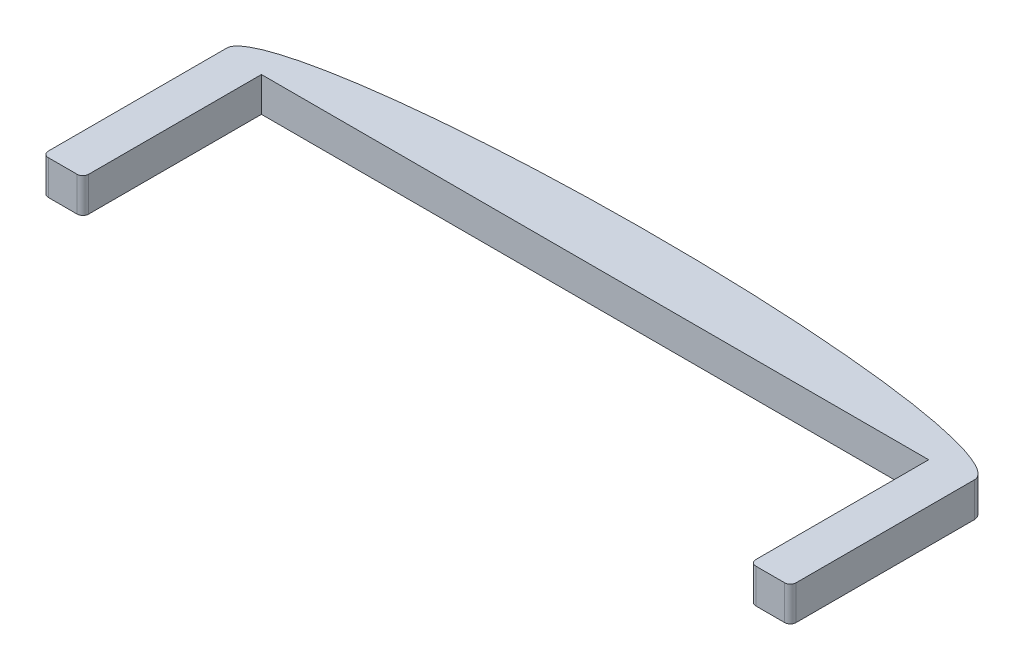
ISO-10303-21;
HEADER;
FILE_DESCRIPTION(('STEP AP214'),'2;1');
FILE_NAME('part.step','',(''),(''),'','','');
FILE_SCHEMA(('AUTOMOTIVE_DESIGN { 1 0 10303 214 1 1 1 1 }'));
ENDSEC;
DATA;
#1=APPLICATION_CONTEXT('core data for automotive mechanical design processes');
#2=APPLICATION_PROTOCOL_DEFINITION('international standard','automotive_design',2000,#1);
#3=PRODUCT_CONTEXT('',#1,'mechanical');
#4=PRODUCT('Part','Part','',(#3));
#5=PRODUCT_RELATED_PRODUCT_CATEGORY('part','',(#4));
#6=PRODUCT_DEFINITION_FORMATION('','',#4);
#7=PRODUCT_DEFINITION_CONTEXT('part definition',#1,'design');
#8=PRODUCT_DEFINITION('design','',#6,#7);
#9=PRODUCT_DEFINITION_SHAPE('','',#8);
#10=(LENGTH_UNIT() NAMED_UNIT(*) SI_UNIT(.MILLI.,.METRE.));
#11=(NAMED_UNIT(*) PLANE_ANGLE_UNIT() SI_UNIT($,.RADIAN.));
#12=(NAMED_UNIT(*) SI_UNIT($,.STERADIAN.) SOLID_ANGLE_UNIT());
#13=UNCERTAINTY_MEASURE_WITH_UNIT(LENGTH_MEASURE(1.E-05),#10,'distance_accuracy_value','');
#14=(GEOMETRIC_REPRESENTATION_CONTEXT(3) GLOBAL_UNCERTAINTY_ASSIGNED_CONTEXT((#13)) GLOBAL_UNIT_ASSIGNED_CONTEXT((#10,
#11,#12)) REPRESENTATION_CONTEXT('',''));
#15=CARTESIAN_POINT('',(0.,0.,0.));
#16=DIRECTION('',(0.,0.,1.));
#17=DIRECTION('',(1.,0.,0.));
#18=AXIS2_PLACEMENT_3D('',#15,#16,#17);
#19=CARTESIAN_POINT('',(0.,3.,0.));
#20=DIRECTION('',(0.,0.,-1.));
#21=DIRECTION('',(-1.,0.,0.));
#22=AXIS2_PLACEMENT_3D('',#19,#20,#21);
#23=PLANE('',#22);
#24=DIRECTION('',(1.,0.,0.));
#25=VECTOR('',#24,1.);
#26=CARTESIAN_POINT('',(0.,3.,0.));
#27=LINE('',#26,#25);
#28=CARTESIAN_POINT('',(29.5,3.,0.));
#29=VERTEX_POINT('',#28);
#30=CARTESIAN_POINT('',(32.,3.,0.));
#31=VERTEX_POINT('',#30);
#32=EDGE_CURVE('E235',#29,#31,#27,.T.);
#33=ORIENTED_EDGE('',*,*,#32,.F.);
#34=DIRECTION('',(0.,-1.,0.));
#35=VECTOR('',#34,1.);
#36=CARTESIAN_POINT('',(29.5,3.,0.));
#37=LINE('',#36,#35);
#38=CARTESIAN_POINT('',(29.5,0.,0.));
#39=VERTEX_POINT('',#38);
#40=EDGE_CURVE('E42',#29,#39,#37,.T.);
#41=ORIENTED_EDGE('',*,*,#40,.T.);
#42=DIRECTION('',(1.,0.,0.));
#43=VECTOR('',#42,1.);
#44=CARTESIAN_POINT('',(0.,0.,0.));
#45=LINE('',#44,#43);
#46=CARTESIAN_POINT('',(32.,0.,0.));
#47=VERTEX_POINT('',#46);
#48=EDGE_CURVE('E221',#39,#47,#45,.T.);
#49=ORIENTED_EDGE('',*,*,#48,.T.);
#50=DIRECTION('',(0.,-1.,0.));
#51=VECTOR('',#50,1.);
#52=CARTESIAN_POINT('',(32.,3.,0.));
#53=LINE('',#52,#51);
#54=EDGE_CURVE('E254',#47,#31,#53,.F.);
#55=ORIENTED_EDGE('',*,*,#54,.T.);
#56=EDGE_LOOP('',(#33,#41,#49,#55));
#57=FACE_BOUND('',#56,.T.);
#58=ADVANCED_FACE('F34',(#57),#23,.F.);
#59=CARTESIAN_POINT('',(0.,3.,-16.));
#60=DIRECTION('',(0.,1.,0.));
#61=DIRECTION('',(-1.,0.,0.));
#62=AXIS2_PLACEMENT_3D('',#59,#60,#61);
#63=ELLIPSE('',#62,32.5,4.5);
#64=DIRECTION('',(0.,-1.,0.));
#65=VECTOR('',#64,1.);
#66=SURFACE_OF_LINEAR_EXTRUSION('',#63,#65);
#67=CARTESIAN_POINT('',(0.,0.,-16.));
#68=DIRECTION('',(0.,1.,0.));
#69=DIRECTION('',(-1.,0.,0.));
#70=AXIS2_PLACEMENT_3D('',#67,#68,#69);
#71=ELLIPSE('',#70,32.5,4.5);
#72=CARTESIAN_POINT('',(32.5,0.,-16.));
#73=VERTEX_POINT('',#72);
#74=CARTESIAN_POINT('',(-32.5,0.,-16.));
#75=VERTEX_POINT('',#74);
#76=EDGE_CURVE('E164',#73,#75,#71,.T.);
#77=ORIENTED_EDGE('',*,*,#76,.T.);
#78=DIRECTION('',(0.,-1.,0.));
#79=VECTOR('',#78,1.);
#80=CARTESIAN_POINT('',(-32.5,3.,-16.));
#81=LINE('',#80,#79);
#82=CARTESIAN_POINT('',(-32.5,3.,-16.));
#83=VERTEX_POINT('',#82);
#84=EDGE_CURVE('E244',#83,#75,#81,.T.);
#85=ORIENTED_EDGE('',*,*,#84,.F.);
#86=CARTESIAN_POINT('',(32.5,3.,-16.));
#87=VERTEX_POINT('',#86);
#88=EDGE_CURVE('E165',#87,#83,#63,.T.);
#89=ORIENTED_EDGE('',*,*,#88,.F.);
#90=DIRECTION('',(0.,-1.,0.));
#91=VECTOR('',#90,1.);
#92=CARTESIAN_POINT('',(32.5,3.,-16.));
#93=LINE('',#92,#91);
#94=EDGE_CURVE('E159',#87,#73,#93,.T.);
#95=ORIENTED_EDGE('',*,*,#94,.T.);
#96=EDGE_LOOP('',(#77,#85,#89,#95));
#97=FACE_BOUND('',#96,.T.);
#98=ADVANCED_FACE('F172',(#97),#66,.F.);
#99=CARTESIAN_POINT('',(-32.5,3.,0.));
#100=DIRECTION('',(1.,0.,0.));
#101=DIRECTION('',(0.,0.,-1.));
#102=AXIS2_PLACEMENT_3D('',#99,#100,#101);
#103=PLANE('',#102);
#104=DIRECTION('',(0.,0.,1.));
#105=VECTOR('',#104,1.);
#106=CARTESIAN_POINT('',(-32.5,0.,0.));
#107=LINE('',#106,#105);
#108=CARTESIAN_POINT('',(-32.5,0.,-0.499999999999996));
#109=VERTEX_POINT('',#108);
#110=EDGE_CURVE('E239',#75,#109,#107,.T.);
#111=ORIENTED_EDGE('',*,*,#110,.T.);
#112=DIRECTION('',(0.,-1.,0.));
#113=VECTOR('',#112,1.);
#114=CARTESIAN_POINT('',(-32.5,3.,-0.499999999999996));
#115=LINE('',#114,#113);
#116=CARTESIAN_POINT('',(-32.5,3.,-0.499999999999996));
#117=VERTEX_POINT('',#116);
#118=EDGE_CURVE('E261',#109,#117,#115,.F.);
#119=ORIENTED_EDGE('',*,*,#118,.T.);
#120=DIRECTION('',(0.,0.,1.));
#121=VECTOR('',#120,1.);
#122=CARTESIAN_POINT('',(-32.5,3.,0.));
#123=LINE('',#122,#121);
#124=EDGE_CURVE('E168',#83,#117,#123,.T.);
#125=ORIENTED_EDGE('',*,*,#124,.F.);
#126=ORIENTED_EDGE('',*,*,#84,.T.);
#127=EDGE_LOOP('',(#111,#119,#125,#126));
#128=FACE_BOUND('',#127,.T.);
#129=ADVANCED_FACE('F176',(#128),#103,.F.);
#130=CARTESIAN_POINT('',(-32.,0.,0.));
#131=VERTEX_POINT('',#130);
#132=CARTESIAN_POINT('',(-29.5,0.,0.));
#133=VERTEX_POINT('',#132);
#134=EDGE_CURVE('E169',#131,#133,#45,.T.);
#135=ORIENTED_EDGE('',*,*,#134,.T.);
#136=DIRECTION('',(0.,-1.,0.));
#137=VECTOR('',#136,1.);
#138=CARTESIAN_POINT('',(-29.5,3.,0.));
#139=LINE('',#138,#137);
#140=CARTESIAN_POINT('',(-29.5,3.,0.));
#141=VERTEX_POINT('',#140);
#142=EDGE_CURVE('E217',#133,#141,#139,.F.);
#143=ORIENTED_EDGE('',*,*,#142,.T.);
#144=CARTESIAN_POINT('',(-32.,3.,0.));
#145=VERTEX_POINT('',#144);
#146=EDGE_CURVE('E248',#145,#141,#27,.T.);
#147=ORIENTED_EDGE('',*,*,#146,.F.);
#148=DIRECTION('',(0.,-1.,0.));
#149=VECTOR('',#148,1.);
#150=CARTESIAN_POINT('',(-32.,3.,0.));
#151=LINE('',#150,#149);
#152=EDGE_CURVE('E219',#145,#131,#151,.T.);
#153=ORIENTED_EDGE('',*,*,#152,.T.);
#154=EDGE_LOOP('',(#135,#143,#147,#153));
#155=FACE_BOUND('',#154,.T.);
#156=ADVANCED_FACE('F199',(#155),#23,.F.);
#157=CARTESIAN_POINT('',(0.,3.,-16.));
#158=DIRECTION('',(0.,1.,0.));
#159=DIRECTION('',(0.,0.,1.));
#160=AXIS2_PLACEMENT_3D('',#157,#158,#159);
#161=PLANE('',#160);
#162=ORIENTED_EDGE('',*,*,#146,.T.);
#163=CARTESIAN_POINT('',(-29.5,3.,-0.499999999999996));
#164=DIRECTION('',(0.,1.,0.));
#165=DIRECTION('',(0.,0.,1.));
#166=AXIS2_PLACEMENT_3D('',#163,#164,#165);
#167=CIRCLE('',#166,0.5);
#168=CARTESIAN_POINT('',(-29.,3.,-0.499999999999996));
#169=VERTEX_POINT('',#168);
#170=EDGE_CURVE('E129',#141,#169,#167,.T.);
#171=ORIENTED_EDGE('',*,*,#170,.T.);
#172=DIRECTION('',(0.,0.,-1.));
#173=VECTOR('',#172,1.);
#174=CARTESIAN_POINT('',(-29.,3.,-1.82150000000006));
#175=LINE('',#174,#173);
#176=CARTESIAN_POINT('',(-29.,3.,-15.5215000000001));
#177=VERTEX_POINT('',#176);
#178=EDGE_CURVE('E122',#169,#177,#175,.T.);
#179=ORIENTED_EDGE('',*,*,#178,.T.);
#180=DIRECTION('',(1.,0.,0.));
#181=VECTOR('',#180,1.);
#182=CARTESIAN_POINT('',(29.,3.,-15.5215000000001));
#183=LINE('',#182,#181);
#184=CARTESIAN_POINT('',(29.,3.,-15.5215000000001));
#185=VERTEX_POINT('',#184);
#186=EDGE_CURVE('E127',#177,#185,#183,.T.);
#187=ORIENTED_EDGE('',*,*,#186,.T.);
#188=DIRECTION('',(0.,0.,1.));
#189=VECTOR('',#188,1.);
#190=CARTESIAN_POINT('',(29.,3.,-1.82150000000006));
#191=LINE('',#190,#189);
#192=CARTESIAN_POINT('',(29.,3.,-0.500000000000004));
#193=VERTEX_POINT('',#192);
#194=EDGE_CURVE('E133',#185,#193,#191,.T.);
#195=ORIENTED_EDGE('',*,*,#194,.T.);
#196=CARTESIAN_POINT('',(29.5,3.,-0.500000000000004));
#197=DIRECTION('',(0.,1.,0.));
#198=DIRECTION('',(0.,0.,1.));
#199=AXIS2_PLACEMENT_3D('',#196,#197,#198);
#200=CIRCLE('',#199,0.5);
#201=EDGE_CURVE('E49',#193,#29,#200,.T.);
#202=ORIENTED_EDGE('',*,*,#201,.T.);
#203=ORIENTED_EDGE('',*,*,#32,.T.);
#204=CARTESIAN_POINT('',(32.,3.,-0.500000000000004));
#205=DIRECTION('',(0.,1.,0.));
#206=DIRECTION('',(0.,0.,1.));
#207=AXIS2_PLACEMENT_3D('',#204,#205,#206);
#208=CIRCLE('',#207,0.5);
#209=CARTESIAN_POINT('',(32.5,3.,-0.500000000000004));
#210=VERTEX_POINT('',#209);
#211=EDGE_CURVE('E258',#31,#210,#208,.T.);
#212=ORIENTED_EDGE('',*,*,#211,.T.);
#213=DIRECTION('',(0.,0.,1.));
#214=VECTOR('',#213,1.);
#215=CARTESIAN_POINT('',(32.5,3.,0.));
#216=LINE('',#215,#214);
#217=EDGE_CURVE('E156',#87,#210,#216,.T.);
#218=ORIENTED_EDGE('',*,*,#217,.F.);
#219=ORIENTED_EDGE('',*,*,#88,.T.);
#220=ORIENTED_EDGE('',*,*,#124,.T.);
#221=CARTESIAN_POINT('',(-32.,3.,-0.499999999999996));
#222=DIRECTION('',(0.,1.,0.));
#223=DIRECTION('',(0.,0.,1.));
#224=AXIS2_PLACEMENT_3D('',#221,#222,#223);
#225=CIRCLE('',#224,0.5);
#226=EDGE_CURVE('E256',#117,#145,#225,.T.);
#227=ORIENTED_EDGE('',*,*,#226,.T.);
#228=EDGE_LOOP('',(#162,#171,#179,#187,#195,#202,#203,#212,#218,#219,#220,#227));
#229=FACE_BOUND('',#228,.T.);
#230=ADVANCED_FACE('F125',(#229),#161,.T.);
#231=CARTESIAN_POINT('',(0.,0.,-16.));
#232=DIRECTION('',(0.,1.,0.));
#233=DIRECTION('',(0.,0.,1.));
#234=AXIS2_PLACEMENT_3D('',#231,#232,#233);
#235=PLANE('',#234);
#236=DIRECTION('',(0.,0.,-1.));
#237=VECTOR('',#236,1.);
#238=CARTESIAN_POINT('',(-29.,0.,-1.82150000000006));
#239=LINE('',#238,#237);
#240=CARTESIAN_POINT('',(-29.,0.,-0.499999999999997));
#241=VERTEX_POINT('',#240);
#242=CARTESIAN_POINT('',(-29.,0.,-15.5215000000001));
#243=VERTEX_POINT('',#242);
#244=EDGE_CURVE('E139',#241,#243,#239,.T.);
#245=ORIENTED_EDGE('',*,*,#244,.F.);
#246=CARTESIAN_POINT('',(-29.5,0.,-0.499999999999996));
#247=DIRECTION('',(0.,1.,0.));
#248=DIRECTION('',(0.,0.,1.));
#249=AXIS2_PLACEMENT_3D('',#246,#247,#248);
#250=CIRCLE('',#249,0.5);
#251=EDGE_CURVE('E223',#241,#133,#250,.F.);
#252=ORIENTED_EDGE('',*,*,#251,.T.);
#253=ORIENTED_EDGE('',*,*,#134,.F.);
#254=CARTESIAN_POINT('',(-32.,0.,-0.499999999999996));
#255=DIRECTION('',(0.,1.,0.));
#256=DIRECTION('',(0.,0.,1.));
#257=AXIS2_PLACEMENT_3D('',#254,#255,#256);
#258=CIRCLE('',#257,0.5);
#259=EDGE_CURVE('E251',#131,#109,#258,.F.);
#260=ORIENTED_EDGE('',*,*,#259,.T.);
#261=ORIENTED_EDGE('',*,*,#110,.F.);
#262=ORIENTED_EDGE('',*,*,#76,.F.);
#263=DIRECTION('',(0.,0.,1.));
#264=VECTOR('',#263,1.);
#265=CARTESIAN_POINT('',(32.5,0.,0.));
#266=LINE('',#265,#264);
#267=CARTESIAN_POINT('',(32.5,0.,-0.500000000000004));
#268=VERTEX_POINT('',#267);
#269=EDGE_CURVE('E154',#73,#268,#266,.T.);
#270=ORIENTED_EDGE('',*,*,#269,.T.);
#271=CARTESIAN_POINT('',(32.,0.,-0.500000000000004));
#272=DIRECTION('',(0.,1.,0.));
#273=DIRECTION('',(0.,0.,1.));
#274=AXIS2_PLACEMENT_3D('',#271,#272,#273);
#275=CIRCLE('',#274,0.5);
#276=EDGE_CURVE('E237',#268,#47,#275,.F.);
#277=ORIENTED_EDGE('',*,*,#276,.T.);
#278=ORIENTED_EDGE('',*,*,#48,.F.);
#279=CARTESIAN_POINT('',(29.5,0.,-0.500000000000004));
#280=DIRECTION('',(0.,1.,0.));
#281=DIRECTION('',(0.,0.,1.));
#282=AXIS2_PLACEMENT_3D('',#279,#280,#281);
#283=CIRCLE('',#282,0.5);
#284=CARTESIAN_POINT('',(29.,0.,-0.500000000000004));
#285=VERTEX_POINT('',#284);
#286=EDGE_CURVE('E226',#39,#285,#283,.F.);
#287=ORIENTED_EDGE('',*,*,#286,.T.);
#288=DIRECTION('',(0.,0.,1.));
#289=VECTOR('',#288,1.);
#290=CARTESIAN_POINT('',(29.,0.,-1.82150000000006));
#291=LINE('',#290,#289);
#292=CARTESIAN_POINT('',(29.,0.,-15.5215000000001));
#293=VERTEX_POINT('',#292);
#294=EDGE_CURVE('E149',#293,#285,#291,.T.);
#295=ORIENTED_EDGE('',*,*,#294,.F.);
#296=DIRECTION('',(1.,0.,0.));
#297=VECTOR('',#296,1.);
#298=CARTESIAN_POINT('',(29.,0.,-15.5215000000001));
#299=LINE('',#298,#297);
#300=EDGE_CURVE('E152',#243,#293,#299,.T.);
#301=ORIENTED_EDGE('',*,*,#300,.F.);
#302=EDGE_LOOP('',(#245,#252,#253,#260,#261,#262,#270,#277,#278,#287,#295,#301));
#303=FACE_BOUND('',#302,.T.);
#304=ADVANCED_FACE('F209',(#303),#235,.F.);
#305=CARTESIAN_POINT('',(32.5,3.,0.));
#306=DIRECTION('',(1.,0.,0.));
#307=DIRECTION('',(0.,0.,-1.));
#308=AXIS2_PLACEMENT_3D('',#305,#306,#307);
#309=PLANE('',#308);
#310=ORIENTED_EDGE('',*,*,#217,.T.);
#311=DIRECTION('',(0.,-1.,0.));
#312=VECTOR('',#311,1.);
#313=CARTESIAN_POINT('',(32.5,0.,-0.500000000000004));
#314=LINE('',#313,#312);
#315=EDGE_CURVE('E247',#210,#268,#314,.T.);
#316=ORIENTED_EDGE('',*,*,#315,.T.);
#317=ORIENTED_EDGE('',*,*,#269,.F.);
#318=ORIENTED_EDGE('',*,*,#94,.F.);
#319=EDGE_LOOP('',(#310,#316,#317,#318));
#320=FACE_BOUND('',#319,.T.);
#321=ADVANCED_FACE('F183',(#320),#309,.T.);
#322=CARTESIAN_POINT('',(32.,3.,-0.500000000000004));
#323=DIRECTION('',(0.,1.,0.));
#324=DIRECTION('',(0.,0.,1.));
#325=AXIS2_PLACEMENT_3D('',#322,#323,#324);
#326=CYLINDRICAL_SURFACE('',#325,0.5);
#327=ORIENTED_EDGE('',*,*,#211,.F.);
#328=ORIENTED_EDGE('',*,*,#54,.F.);
#329=ORIENTED_EDGE('',*,*,#276,.F.);
#330=ORIENTED_EDGE('',*,*,#315,.F.);
#331=EDGE_LOOP('',(#327,#328,#329,#330));
#332=FACE_BOUND('',#331,.T.);
#333=ADVANCED_FACE('F179',(#332),#326,.T.);
#334=CARTESIAN_POINT('',(-32.,3.,-0.499999999999996));
#335=DIRECTION('',(0.,-1.,0.));
#336=DIRECTION('',(0.,0.,-1.));
#337=AXIS2_PLACEMENT_3D('',#334,#335,#336);
#338=CYLINDRICAL_SURFACE('',#337,0.5);
#339=ORIENTED_EDGE('',*,*,#226,.F.);
#340=ORIENTED_EDGE('',*,*,#118,.F.);
#341=ORIENTED_EDGE('',*,*,#259,.F.);
#342=ORIENTED_EDGE('',*,*,#152,.F.);
#343=EDGE_LOOP('',(#339,#340,#341,#342));
#344=FACE_BOUND('',#343,.T.);
#345=ADVANCED_FACE('F182',(#344),#338,.T.);
#346=CARTESIAN_POINT('',(29.,3.,-15.5215000000001));
#347=DIRECTION('',(0.,0.,-1.));
#348=DIRECTION('',(-1.,0.,0.));
#349=AXIS2_PLACEMENT_3D('',#346,#347,#348);
#350=PLANE('',#349);
#351=ORIENTED_EDGE('',*,*,#300,.T.);
#352=DIRECTION('',(0.,-1.,0.));
#353=VECTOR('',#352,1.);
#354=CARTESIAN_POINT('',(29.,3.,-15.5215000000001));
#355=LINE('',#354,#353);
#356=EDGE_CURVE('E142',#185,#293,#355,.T.);
#357=ORIENTED_EDGE('',*,*,#356,.F.);
#358=ORIENTED_EDGE('',*,*,#186,.F.);
#359=DIRECTION('',(0.,-1.,0.));
#360=VECTOR('',#359,1.);
#361=CARTESIAN_POINT('',(-29.,3.,-15.5215000000001));
#362=LINE('',#361,#360);
#363=EDGE_CURVE('E136',#177,#243,#362,.T.);
#364=ORIENTED_EDGE('',*,*,#363,.T.);
#365=EDGE_LOOP('',(#351,#357,#358,#364));
#366=FACE_BOUND('',#365,.T.);
#367=ADVANCED_FACE('F144',(#366),#350,.F.);
#368=CARTESIAN_POINT('',(-29.,3.,-1.82150000000006));
#369=DIRECTION('',(-1.,0.,0.));
#370=DIRECTION('',(0.,0.,1.));
#371=AXIS2_PLACEMENT_3D('',#368,#369,#370);
#372=PLANE('',#371);
#373=ORIENTED_EDGE('',*,*,#178,.F.);
#374=DIRECTION('',(0.,-1.,0.));
#375=VECTOR('',#374,1.);
#376=CARTESIAN_POINT('',(-29.,3.,-0.499999999999996));
#377=LINE('',#376,#375);
#378=EDGE_CURVE('E263',#169,#241,#377,.T.);
#379=ORIENTED_EDGE('',*,*,#378,.T.);
#380=ORIENTED_EDGE('',*,*,#244,.T.);
#381=ORIENTED_EDGE('',*,*,#363,.F.);
#382=EDGE_LOOP('',(#373,#379,#380,#381));
#383=FACE_BOUND('',#382,.T.);
#384=ADVANCED_FACE('F137',(#383),#372,.F.);
#385=CARTESIAN_POINT('',(29.,3.,-1.82150000000006));
#386=DIRECTION('',(1.,0.,0.));
#387=DIRECTION('',(0.,0.,-1.));
#388=AXIS2_PLACEMENT_3D('',#385,#386,#387);
#389=PLANE('',#388);
#390=ORIENTED_EDGE('',*,*,#294,.T.);
#391=DIRECTION('',(0.,-1.,0.));
#392=VECTOR('',#391,1.);
#393=CARTESIAN_POINT('',(29.,3.,-0.500000000000004));
#394=LINE('',#393,#392);
#395=EDGE_CURVE('E11',#285,#193,#394,.F.);
#396=ORIENTED_EDGE('',*,*,#395,.T.);
#397=ORIENTED_EDGE('',*,*,#194,.F.);
#398=ORIENTED_EDGE('',*,*,#356,.T.);
#399=EDGE_LOOP('',(#390,#396,#397,#398));
#400=FACE_BOUND('',#399,.T.);
#401=ADVANCED_FACE('F189',(#400),#389,.F.);
#402=CARTESIAN_POINT('',(-29.5,3.,-0.499999999999996));
#403=DIRECTION('',(0.,-1.,0.));
#404=DIRECTION('',(0.,0.,-1.));
#405=AXIS2_PLACEMENT_3D('',#402,#403,#404);
#406=CYLINDRICAL_SURFACE('',#405,0.5);
#407=ORIENTED_EDGE('',*,*,#170,.F.);
#408=ORIENTED_EDGE('',*,*,#142,.F.);
#409=ORIENTED_EDGE('',*,*,#251,.F.);
#410=ORIENTED_EDGE('',*,*,#378,.F.);
#411=EDGE_LOOP('',(#407,#408,#409,#410));
#412=FACE_BOUND('',#411,.T.);
#413=ADVANCED_FACE('F187',(#412),#406,.T.);
#414=CARTESIAN_POINT('',(29.5,3.,-0.500000000000004));
#415=DIRECTION('',(0.,-1.,0.));
#416=DIRECTION('',(0.,0.,-1.));
#417=AXIS2_PLACEMENT_3D('',#414,#415,#416);
#418=CYLINDRICAL_SURFACE('',#417,0.5);
#419=ORIENTED_EDGE('',*,*,#201,.F.);
#420=ORIENTED_EDGE('',*,*,#395,.F.);
#421=ORIENTED_EDGE('',*,*,#286,.F.);
#422=ORIENTED_EDGE('',*,*,#40,.F.);
#423=EDGE_LOOP('',(#419,#420,#421,#422));
#424=FACE_BOUND('',#423,.T.);
#425=ADVANCED_FACE('F36',(#424),#418,.T.);
#426=CLOSED_SHELL('',(#58,#98,#129,#156,#230,#304,#321,#333,#345,#367,#384,#401,#413,#425));
#427=MANIFOLD_SOLID_BREP('B2',#426);
#428=ADVANCED_BREP_SHAPE_REPRESENTATION('',(#18,#427),#14);
#429=SHAPE_DEFINITION_REPRESENTATION(#9,#428);
ENDSEC;
END-ISO-10303-21;
